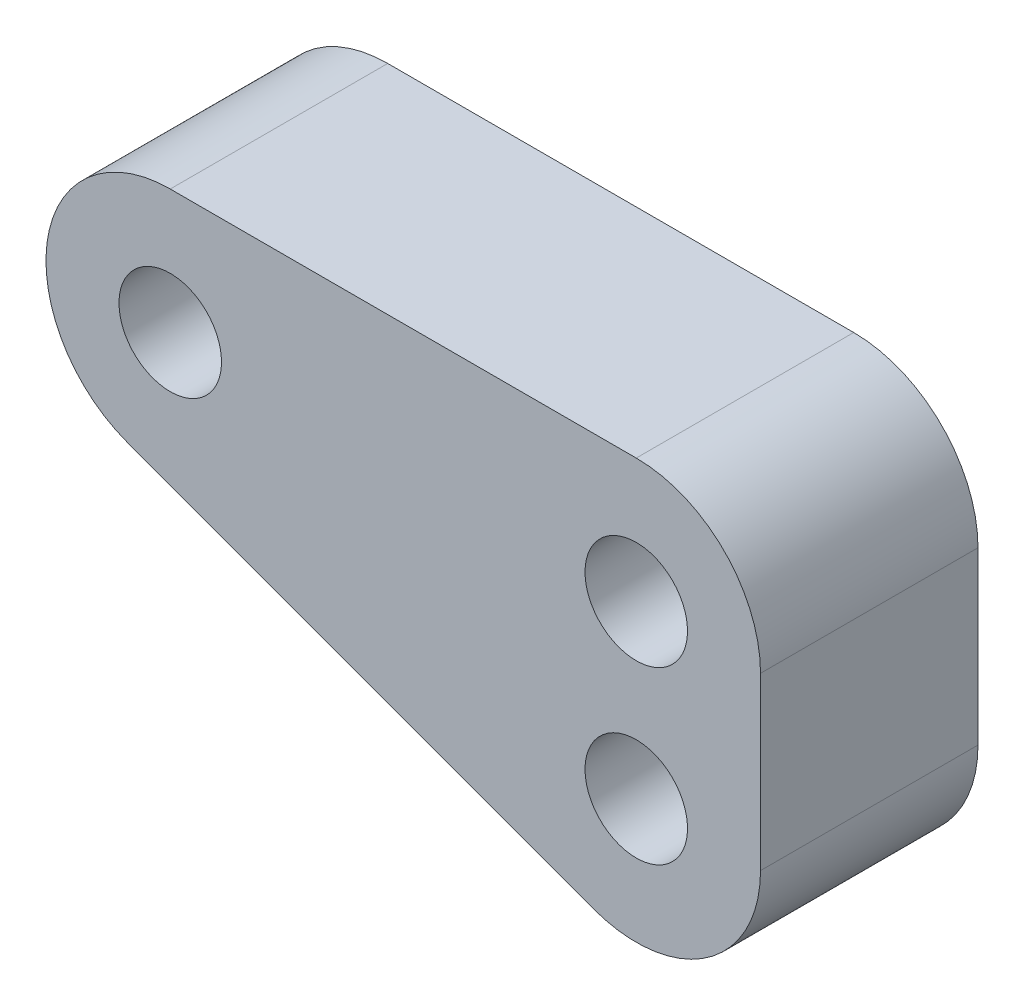
ISO-10303-21;
HEADER;
FILE_DESCRIPTION(('STEP AP214'),'2;1');
FILE_NAME('part.step','',(''),(''),'','','');
FILE_SCHEMA(('AUTOMOTIVE_DESIGN { 1 0 10303 214 1 1 1 1 }'));
ENDSEC;
DATA;
#1=APPLICATION_CONTEXT('core data for automotive mechanical design processes');
#2=APPLICATION_PROTOCOL_DEFINITION('international standard','automotive_design',2000,#1);
#3=PRODUCT_CONTEXT('',#1,'mechanical');
#4=PRODUCT('Part','Part','',(#3));
#5=PRODUCT_RELATED_PRODUCT_CATEGORY('part','',(#4));
#6=PRODUCT_DEFINITION_FORMATION('','',#4);
#7=PRODUCT_DEFINITION_CONTEXT('part definition',#1,'design');
#8=PRODUCT_DEFINITION('design','',#6,#7);
#9=PRODUCT_DEFINITION_SHAPE('','',#8);
#10=(LENGTH_UNIT() NAMED_UNIT(*) SI_UNIT(.MILLI.,.METRE.));
#11=(NAMED_UNIT(*) PLANE_ANGLE_UNIT() SI_UNIT($,.RADIAN.));
#12=(NAMED_UNIT(*) SI_UNIT($,.STERADIAN.) SOLID_ANGLE_UNIT());
#13=UNCERTAINTY_MEASURE_WITH_UNIT(LENGTH_MEASURE(1.E-05),#10,'distance_accuracy_value','');
#14=(GEOMETRIC_REPRESENTATION_CONTEXT(3) GLOBAL_UNCERTAINTY_ASSIGNED_CONTEXT((#13)) GLOBAL_UNIT_ASSIGNED_CONTEXT((#10,
#11,#12)) REPRESENTATION_CONTEXT('',''));
#15=CARTESIAN_POINT('',(0.,0.,0.));
#16=DIRECTION('',(0.,0.,1.));
#17=DIRECTION('',(1.,0.,0.));
#18=AXIS2_PLACEMENT_3D('',#15,#16,#17);
#19=CARTESIAN_POINT('',(0.,-5.5,7.));
#20=DIRECTION('',(0.,0.,-1.));
#21=DIRECTION('',(-1.,0.,0.));
#22=AXIS2_PLACEMENT_3D('',#19,#20,#21);
#23=CYLINDRICAL_SURFACE('',#22,4.);
#24=CARTESIAN_POINT('',(0.,-5.5,0.));
#25=DIRECTION('',(0.,0.,1.));
#26=DIRECTION('',(-1.,0.,0.));
#27=AXIS2_PLACEMENT_3D('',#24,#25,#26);
#28=CIRCLE('',#27,4.);
#29=CARTESIAN_POINT('',(-1.37701859663369,-9.25550526354643,0.));
#30=VERTEX_POINT('',#29);
#31=CARTESIAN_POINT('',(4.,-5.5,0.));
#32=VERTEX_POINT('',#31);
#33=EDGE_CURVE('E121',#30,#32,#28,.T.);
#34=ORIENTED_EDGE('',*,*,#33,.T.);
#35=DIRECTION('',(0.,0.,-1.));
#36=VECTOR('',#35,1.);
#37=CARTESIAN_POINT('',(4.,-5.5,7.));
#38=LINE('',#37,#36);
#39=CARTESIAN_POINT('',(4.,-5.5,7.));
#40=VERTEX_POINT('',#39);
#41=EDGE_CURVE('E11',#40,#32,#38,.T.);
#42=ORIENTED_EDGE('',*,*,#41,.F.);
#43=CARTESIAN_POINT('',(0.,-5.5,7.));
#44=DIRECTION('',(0.,0.,1.));
#45=DIRECTION('',(-1.,0.,0.));
#46=AXIS2_PLACEMENT_3D('',#43,#44,#45);
#47=CIRCLE('',#46,4.);
#48=CARTESIAN_POINT('',(-1.37701859663369,-9.25550526354643,7.));
#49=VERTEX_POINT('',#48);
#50=EDGE_CURVE('E132',#49,#40,#47,.T.);
#51=ORIENTED_EDGE('',*,*,#50,.F.);
#52=DIRECTION('',(0.,0.,-1.));
#53=VECTOR('',#52,1.);
#54=CARTESIAN_POINT('',(-1.37701859663369,-9.25550526354643,7.));
#55=LINE('',#54,#53);
#56=EDGE_CURVE('E117',#49,#30,#55,.T.);
#57=ORIENTED_EDGE('',*,*,#56,.T.);
#58=EDGE_LOOP('',(#34,#42,#51,#57));
#59=FACE_BOUND('',#58,.T.);
#60=ADVANCED_FACE('F37',(#59),#23,.T.);
#61=CARTESIAN_POINT('',(4.,0.,7.));
#62=DIRECTION('',(-1.,0.,0.));
#63=DIRECTION('',(0.,-1.,0.));
#64=AXIS2_PLACEMENT_3D('',#61,#62,#63);
#65=PLANE('',#64);
#66=DIRECTION('',(0.,1.,0.));
#67=VECTOR('',#66,1.);
#68=CARTESIAN_POINT('',(4.,0.,0.));
#69=LINE('',#68,#67);
#70=CARTESIAN_POINT('',(4.,0.,0.));
#71=VERTEX_POINT('',#70);
#72=EDGE_CURVE('E124',#32,#71,#69,.T.);
#73=ORIENTED_EDGE('',*,*,#72,.T.);
#74=DIRECTION('',(0.,0.,-1.));
#75=VECTOR('',#74,1.);
#76=CARTESIAN_POINT('',(4.,0.,7.));
#77=LINE('',#76,#75);
#78=CARTESIAN_POINT('',(4.,0.,7.));
#79=VERTEX_POINT('',#78);
#80=EDGE_CURVE('E45',#79,#71,#77,.T.);
#81=ORIENTED_EDGE('',*,*,#80,.F.);
#82=DIRECTION('',(0.,1.,0.));
#83=VECTOR('',#82,1.);
#84=CARTESIAN_POINT('',(4.,0.,7.));
#85=LINE('',#84,#83);
#86=EDGE_CURVE('E90',#40,#79,#85,.T.);
#87=ORIENTED_EDGE('',*,*,#86,.F.);
#88=ORIENTED_EDGE('',*,*,#41,.T.);
#89=EDGE_LOOP('',(#73,#81,#87,#88));
#90=FACE_BOUND('',#89,.T.);
#91=ADVANCED_FACE('F157',(#90),#65,.F.);
#92=CARTESIAN_POINT('',(0.,0.,7.));
#93=DIRECTION('',(0.,0.,-1.));
#94=DIRECTION('',(-1.,0.,0.));
#95=AXIS2_PLACEMENT_3D('',#92,#93,#94);
#96=CYLINDRICAL_SURFACE('',#95,4.);
#97=CARTESIAN_POINT('',(0.,0.,0.));
#98=DIRECTION('',(0.,0.,1.));
#99=DIRECTION('',(-1.,0.,0.));
#100=AXIS2_PLACEMENT_3D('',#97,#98,#99);
#101=CIRCLE('',#100,4.);
#102=CARTESIAN_POINT('',(0.,4.,0.));
#103=VERTEX_POINT('',#102);
#104=EDGE_CURVE('E127',#71,#103,#101,.T.);
#105=ORIENTED_EDGE('',*,*,#104,.T.);
#106=DIRECTION('',(0.,0.,-1.));
#107=VECTOR('',#106,1.);
#108=CARTESIAN_POINT('',(0.,4.,7.));
#109=LINE('',#108,#107);
#110=CARTESIAN_POINT('',(0.,4.,7.));
#111=VERTEX_POINT('',#110);
#112=EDGE_CURVE('E112',#111,#103,#109,.T.);
#113=ORIENTED_EDGE('',*,*,#112,.F.);
#114=CARTESIAN_POINT('',(0.,0.,7.));
#115=DIRECTION('',(0.,0.,1.));
#116=DIRECTION('',(-1.,0.,0.));
#117=AXIS2_PLACEMENT_3D('',#114,#115,#116);
#118=CIRCLE('',#117,4.);
#119=EDGE_CURVE('E103',#79,#111,#118,.T.);
#120=ORIENTED_EDGE('',*,*,#119,.F.);
#121=ORIENTED_EDGE('',*,*,#80,.T.);
#122=EDGE_LOOP('',(#105,#113,#120,#121));
#123=FACE_BOUND('',#122,.T.);
#124=ADVANCED_FACE('F138',(#123),#96,.T.);
#125=CARTESIAN_POINT('',(-15.,4.,7.));
#126=DIRECTION('',(0.,-1.,0.));
#127=DIRECTION('',(0.,0.,-1.));
#128=AXIS2_PLACEMENT_3D('',#125,#126,#127);
#129=PLANE('',#128);
#130=DIRECTION('',(-1.,0.,0.));
#131=VECTOR('',#130,1.);
#132=CARTESIAN_POINT('',(-15.,4.,0.));
#133=LINE('',#132,#131);
#134=CARTESIAN_POINT('',(-15.,4.,0.));
#135=VERTEX_POINT('',#134);
#136=EDGE_CURVE('E111',#103,#135,#133,.T.);
#137=ORIENTED_EDGE('',*,*,#136,.T.);
#138=DIRECTION('',(0.,0.,-1.));
#139=VECTOR('',#138,1.);
#140=CARTESIAN_POINT('',(-15.,4.,7.));
#141=LINE('',#140,#139);
#142=CARTESIAN_POINT('',(-15.,4.,7.));
#143=VERTEX_POINT('',#142);
#144=EDGE_CURVE('E108',#143,#135,#141,.T.);
#145=ORIENTED_EDGE('',*,*,#144,.F.);
#146=DIRECTION('',(-1.,0.,0.));
#147=VECTOR('',#146,1.);
#148=CARTESIAN_POINT('',(-15.,4.,7.));
#149=LINE('',#148,#147);
#150=EDGE_CURVE('E97',#111,#143,#149,.T.);
#151=ORIENTED_EDGE('',*,*,#150,.F.);
#152=ORIENTED_EDGE('',*,*,#112,.T.);
#153=EDGE_LOOP('',(#137,#145,#151,#152));
#154=FACE_BOUND('',#153,.T.);
#155=ADVANCED_FACE('F109',(#154),#129,.F.);
#156=CARTESIAN_POINT('',(-15.,0.,7.));
#157=DIRECTION('',(0.,0.,-1.));
#158=DIRECTION('',(-1.,0.,0.));
#159=AXIS2_PLACEMENT_3D('',#156,#157,#158);
#160=CYLINDRICAL_SURFACE('',#159,4.);
#161=CARTESIAN_POINT('',(-15.,0.,0.));
#162=DIRECTION('',(0.,0.,1.));
#163=DIRECTION('',(1.,0.,0.));
#164=AXIS2_PLACEMENT_3D('',#161,#162,#163);
#165=CIRCLE('',#164,4.);
#166=CARTESIAN_POINT('',(-16.3770185966337,-3.75550526354643,0.));
#167=VERTEX_POINT('',#166);
#168=EDGE_CURVE('E76',#135,#167,#165,.T.);
#169=ORIENTED_EDGE('',*,*,#168,.T.);
#170=DIRECTION('',(0.,0.,-1.));
#171=VECTOR('',#170,1.);
#172=CARTESIAN_POINT('',(-16.3770185966337,-3.75550526354643,7.));
#173=LINE('',#172,#171);
#174=CARTESIAN_POINT('',(-16.3770185966337,-3.75550526354643,7.));
#175=VERTEX_POINT('',#174);
#176=EDGE_CURVE('E113',#175,#167,#173,.T.);
#177=ORIENTED_EDGE('',*,*,#176,.F.);
#178=CARTESIAN_POINT('',(-15.,0.,7.));
#179=DIRECTION('',(0.,0.,1.));
#180=DIRECTION('',(1.,0.,0.));
#181=AXIS2_PLACEMENT_3D('',#178,#179,#180);
#182=CIRCLE('',#181,4.);
#183=EDGE_CURVE('E101',#143,#175,#182,.T.);
#184=ORIENTED_EDGE('',*,*,#183,.F.);
#185=ORIENTED_EDGE('',*,*,#144,.T.);
#186=EDGE_LOOP('',(#169,#177,#184,#185));
#187=FACE_BOUND('',#186,.T.);
#188=ADVANCED_FACE('F115',(#187),#160,.T.);
#189=CARTESIAN_POINT('',(-1.37701859663369,-9.25550526354643,7.));
#190=DIRECTION('',(0.344254649158423,0.938876315886609,0.));
#191=DIRECTION('',(-0.938876315886609,0.344254649158423,0.));
#192=AXIS2_PLACEMENT_3D('',#189,#190,#191);
#193=PLANE('',#192);
#194=DIRECTION('',(0.938876315886608,-0.344254649158423,0.));
#195=VECTOR('',#194,1.);
#196=CARTESIAN_POINT('',(-1.37701859663369,-9.25550526354643,0.));
#197=LINE('',#196,#195);
#198=EDGE_CURVE('E82',#167,#30,#197,.T.);
#199=ORIENTED_EDGE('',*,*,#198,.T.);
#200=ORIENTED_EDGE('',*,*,#56,.F.);
#201=DIRECTION('',(0.938876315886608,-0.344254649158423,0.));
#202=VECTOR('',#201,1.);
#203=CARTESIAN_POINT('',(-1.37701859663369,-9.25550526354643,7.));
#204=LINE('',#203,#202);
#205=EDGE_CURVE('E53',#175,#49,#204,.T.);
#206=ORIENTED_EDGE('',*,*,#205,.F.);
#207=ORIENTED_EDGE('',*,*,#176,.T.);
#208=EDGE_LOOP('',(#199,#200,#206,#207));
#209=FACE_BOUND('',#208,.T.);
#210=ADVANCED_FACE('F145',(#209),#193,.F.);
#211=CARTESIAN_POINT('',(0.,-5.5,7.));
#212=DIRECTION('',(0.,0.,-1.));
#213=DIRECTION('',(-1.,0.,0.));
#214=AXIS2_PLACEMENT_3D('',#211,#212,#213);
#215=PLANE('',#214);
#216=CARTESIAN_POINT('',(-15.,0.,7.));
#217=DIRECTION('',(0.,0.,-1.));
#218=DIRECTION('',(-1.,0.,0.));
#219=AXIS2_PLACEMENT_3D('',#216,#217,#218);
#220=CIRCLE('',#219,1.65);
#221=CARTESIAN_POINT('',(-16.65,0.,7.));
#222=VERTEX_POINT('',#221);
#223=EDGE_CURVE('E248',#222,#222,#220,.T.);
#224=ORIENTED_EDGE('',*,*,#223,.T.);
#225=EDGE_LOOP('',(#224));
#226=FACE_BOUND('',#225,.T.);
#227=CARTESIAN_POINT('',(0.,0.,7.));
#228=DIRECTION('',(0.,0.,-1.));
#229=DIRECTION('',(-1.,0.,0.));
#230=AXIS2_PLACEMENT_3D('',#227,#228,#229);
#231=CIRCLE('',#230,1.65);
#232=CARTESIAN_POINT('',(-1.65,0.,7.));
#233=VERTEX_POINT('',#232);
#234=EDGE_CURVE('E258',#233,#233,#231,.T.);
#235=ORIENTED_EDGE('',*,*,#234,.T.);
#236=EDGE_LOOP('',(#235));
#237=FACE_BOUND('',#236,.T.);
#238=CARTESIAN_POINT('',(0.,-5.5,7.));
#239=DIRECTION('',(0.,0.,-1.));
#240=DIRECTION('',(-1.,0.,0.));
#241=AXIS2_PLACEMENT_3D('',#238,#239,#240);
#242=CIRCLE('',#241,1.65);
#243=CARTESIAN_POINT('',(-1.65,-5.5,7.));
#244=VERTEX_POINT('',#243);
#245=EDGE_CURVE('E125',#244,#244,#242,.T.);
#246=ORIENTED_EDGE('',*,*,#245,.T.);
#247=EDGE_LOOP('',(#246));
#248=FACE_BOUND('',#247,.T.);
#249=ORIENTED_EDGE('',*,*,#50,.T.);
#250=ORIENTED_EDGE('',*,*,#86,.T.);
#251=ORIENTED_EDGE('',*,*,#119,.T.);
#252=ORIENTED_EDGE('',*,*,#150,.T.);
#253=ORIENTED_EDGE('',*,*,#183,.T.);
#254=ORIENTED_EDGE('',*,*,#205,.T.);
#255=EDGE_LOOP('',(#249,#250,#251,#252,#253,#254));
#256=FACE_BOUND('',#255,.T.);
#257=ADVANCED_FACE('F99',(#226,#237,#248,#256),#215,.F.);
#258=CARTESIAN_POINT('',(0.,-5.5,0.));
#259=DIRECTION('',(0.,0.,-1.));
#260=DIRECTION('',(-1.,0.,0.));
#261=AXIS2_PLACEMENT_3D('',#258,#259,#260);
#262=PLANE('',#261);
#263=CARTESIAN_POINT('',(-15.,0.,0.));
#264=DIRECTION('',(0.,0.,-1.));
#265=DIRECTION('',(-1.,0.,0.));
#266=AXIS2_PLACEMENT_3D('',#263,#264,#265);
#267=CIRCLE('',#266,1.64999999999999);
#268=CARTESIAN_POINT('',(-16.65,0.,0.));
#269=VERTEX_POINT('',#268);
#270=EDGE_CURVE('E251',#269,#269,#267,.T.);
#271=ORIENTED_EDGE('',*,*,#270,.F.);
#272=EDGE_LOOP('',(#271));
#273=FACE_BOUND('',#272,.T.);
#274=CARTESIAN_POINT('',(0.,0.,0.));
#275=DIRECTION('',(0.,0.,-1.));
#276=DIRECTION('',(-1.,0.,0.));
#277=AXIS2_PLACEMENT_3D('',#274,#275,#276);
#278=CIRCLE('',#277,1.64999999999999);
#279=CARTESIAN_POINT('',(-1.64999999999999,0.,0.));
#280=VERTEX_POINT('',#279);
#281=EDGE_CURVE('E253',#280,#280,#278,.T.);
#282=ORIENTED_EDGE('',*,*,#281,.F.);
#283=EDGE_LOOP('',(#282));
#284=FACE_BOUND('',#283,.T.);
#285=CARTESIAN_POINT('',(0.,-5.5,0.));
#286=DIRECTION('',(0.,0.,-1.));
#287=DIRECTION('',(-1.,0.,0.));
#288=AXIS2_PLACEMENT_3D('',#285,#286,#287);
#289=CIRCLE('',#288,1.64999999999999);
#290=CARTESIAN_POINT('',(-1.64999999999999,-5.5,0.));
#291=VERTEX_POINT('',#290);
#292=EDGE_CURVE('E261',#291,#291,#289,.T.);
#293=ORIENTED_EDGE('',*,*,#292,.F.);
#294=EDGE_LOOP('',(#293));
#295=FACE_BOUND('',#294,.T.);
#296=ORIENTED_EDGE('',*,*,#33,.F.);
#297=ORIENTED_EDGE('',*,*,#198,.F.);
#298=ORIENTED_EDGE('',*,*,#168,.F.);
#299=ORIENTED_EDGE('',*,*,#136,.F.);
#300=ORIENTED_EDGE('',*,*,#104,.F.);
#301=ORIENTED_EDGE('',*,*,#72,.F.);
#302=EDGE_LOOP('',(#296,#297,#298,#299,#300,#301));
#303=FACE_BOUND('',#302,.T.);
#304=ADVANCED_FACE('F141',(#273,#284,#295,#303),#262,.T.);
#305=CARTESIAN_POINT('',(0.,-5.5,0.));
#306=DIRECTION('',(0.,0.,-1.));
#307=DIRECTION('',(-1.,0.,0.));
#308=AXIS2_PLACEMENT_3D('',#305,#306,#307);
#309=CYLINDRICAL_SURFACE('',#308,1.64999999999999);
#310=ORIENTED_EDGE('',*,*,#245,.F.);
#311=EDGE_LOOP('',(#310));
#312=FACE_BOUND('',#311,.T.);
#313=ORIENTED_EDGE('',*,*,#292,.T.);
#314=EDGE_LOOP('',(#313));
#315=FACE_BOUND('',#314,.T.);
#316=ADVANCED_FACE('F195',(#312,#315),#309,.F.);
#317=CARTESIAN_POINT('',(0.,0.,0.));
#318=DIRECTION('',(0.,0.,-1.));
#319=DIRECTION('',(-1.,0.,0.));
#320=AXIS2_PLACEMENT_3D('',#317,#318,#319);
#321=CYLINDRICAL_SURFACE('',#320,1.64999999999999);
#322=ORIENTED_EDGE('',*,*,#234,.F.);
#323=EDGE_LOOP('',(#322));
#324=FACE_BOUND('',#323,.T.);
#325=ORIENTED_EDGE('',*,*,#281,.T.);
#326=EDGE_LOOP('',(#325));
#327=FACE_BOUND('',#326,.T.);
#328=ADVANCED_FACE('F208',(#324,#327),#321,.F.);
#329=CARTESIAN_POINT('',(-15.,0.,0.));
#330=DIRECTION('',(0.,0.,-1.));
#331=DIRECTION('',(-1.,0.,0.));
#332=AXIS2_PLACEMENT_3D('',#329,#330,#331);
#333=CYLINDRICAL_SURFACE('',#332,1.64999999999999);
#334=ORIENTED_EDGE('',*,*,#223,.F.);
#335=EDGE_LOOP('',(#334));
#336=FACE_BOUND('',#335,.T.);
#337=ORIENTED_EDGE('',*,*,#270,.T.);
#338=EDGE_LOOP('',(#337));
#339=FACE_BOUND('',#338,.T.);
#340=ADVANCED_FACE('F219',(#336,#339),#333,.F.);
#341=CLOSED_SHELL('',(#60,#91,#124,#155,#188,#210,#257,#304,#316,#328,#340));
#342=MANIFOLD_SOLID_BREP('B2',#341);
#343=ADVANCED_BREP_SHAPE_REPRESENTATION('',(#18,#342),#14);
#344=SHAPE_DEFINITION_REPRESENTATION(#9,#343);
ENDSEC;
END-ISO-10303-21;
